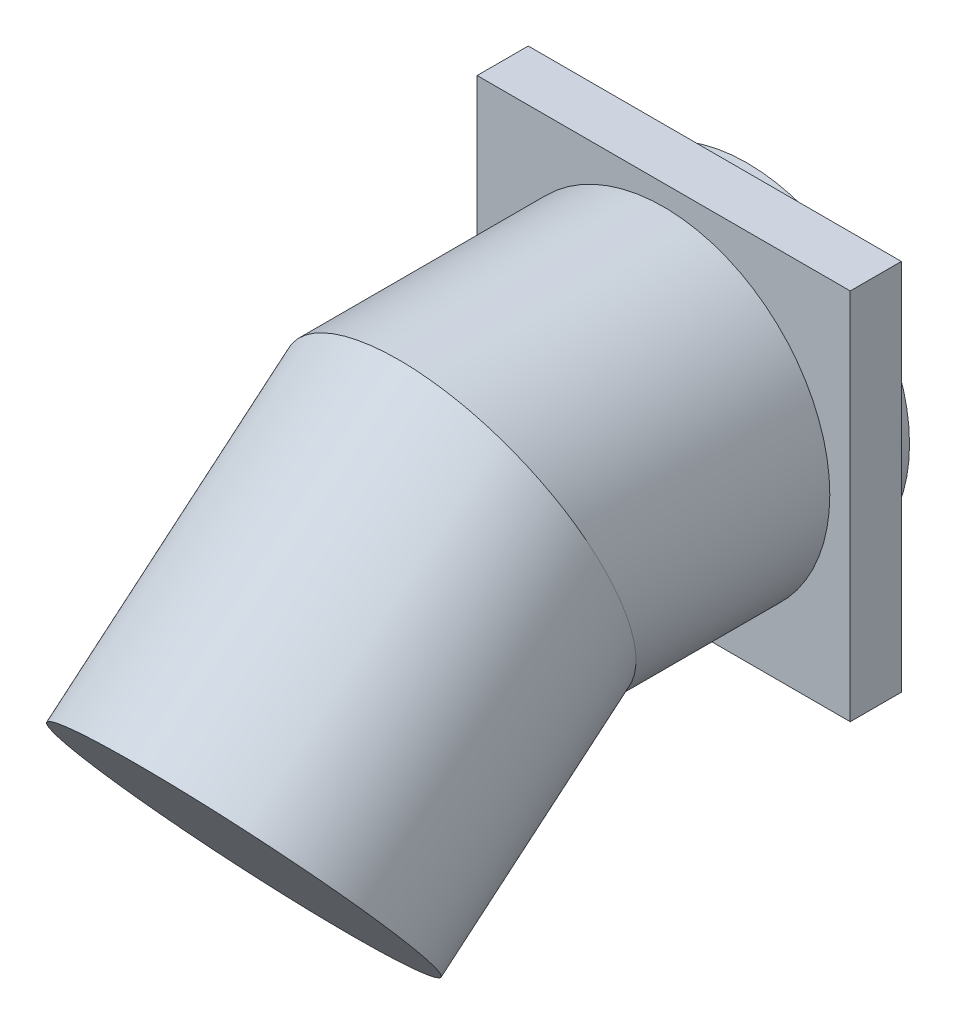
ISO-10303-21;
HEADER;
FILE_DESCRIPTION(('STEP AP214'),'2;1');
FILE_NAME('part.step','',(''),(''),'','','');
FILE_SCHEMA(('AUTOMOTIVE_DESIGN { 1 0 10303 214 1 1 1 1 }'));
ENDSEC;
DATA;
#1=APPLICATION_CONTEXT('core data for automotive mechanical design processes');
#2=APPLICATION_PROTOCOL_DEFINITION('international standard','automotive_design',2000,#1);
#3=PRODUCT_CONTEXT('',#1,'mechanical');
#4=PRODUCT('Part','Part','',(#3));
#5=PRODUCT_RELATED_PRODUCT_CATEGORY('part','',(#4));
#6=PRODUCT_DEFINITION_FORMATION('','',#4);
#7=PRODUCT_DEFINITION_CONTEXT('part definition',#1,'design');
#8=PRODUCT_DEFINITION('design','',#6,#7);
#9=PRODUCT_DEFINITION_SHAPE('','',#8);
#10=(LENGTH_UNIT() NAMED_UNIT(*) SI_UNIT(.MILLI.,.METRE.));
#11=(NAMED_UNIT(*) PLANE_ANGLE_UNIT() SI_UNIT($,.RADIAN.));
#12=(NAMED_UNIT(*) SI_UNIT($,.STERADIAN.) SOLID_ANGLE_UNIT());
#13=UNCERTAINTY_MEASURE_WITH_UNIT(LENGTH_MEASURE(1.E-05),#10,'distance_accuracy_value','');
#14=(GEOMETRIC_REPRESENTATION_CONTEXT(3) GLOBAL_UNCERTAINTY_ASSIGNED_CONTEXT((#13)) GLOBAL_UNIT_ASSIGNED_CONTEXT((#10,
#11,#12)) REPRESENTATION_CONTEXT('',''));
#15=CARTESIAN_POINT('',(0.,0.,0.));
#16=DIRECTION('',(0.,0.,1.));
#17=DIRECTION('',(1.,0.,0.));
#18=AXIS2_PLACEMENT_3D('',#15,#16,#17);
#19=CARTESIAN_POINT('',(-73.,73.,20.));
#20=DIRECTION('',(1.,0.,0.));
#21=DIRECTION('',(0.,1.,0.));
#22=AXIS2_PLACEMENT_3D('',#19,#20,#21);
#23=PLANE('',#22);
#24=DIRECTION('',(0.,-1.,0.));
#25=VECTOR('',#24,1.);
#26=CARTESIAN_POINT('',(-73.,73.,0.));
#27=LINE('',#26,#25);
#28=CARTESIAN_POINT('',(-73.,73.,0.));
#29=VERTEX_POINT('',#28);
#30=CARTESIAN_POINT('',(-73.,-73.,0.));
#31=VERTEX_POINT('',#30);
#32=EDGE_CURVE('E101',#29,#31,#27,.T.);
#33=ORIENTED_EDGE('',*,*,#32,.T.);
#34=DIRECTION('',(0.,0.,-1.));
#35=VECTOR('',#34,1.);
#36=CARTESIAN_POINT('',(-73.,-73.,20.));
#37=LINE('',#36,#35);
#38=CARTESIAN_POINT('',(-73.,-73.,20.));
#39=VERTEX_POINT('',#38);
#40=EDGE_CURVE('E37',#39,#31,#37,.T.);
#41=ORIENTED_EDGE('',*,*,#40,.F.);
#42=DIRECTION('',(0.,-1.,0.));
#43=VECTOR('',#42,1.);
#44=CARTESIAN_POINT('',(-73.,73.,20.));
#45=LINE('',#44,#43);
#46=CARTESIAN_POINT('',(-73.,73.,20.));
#47=VERTEX_POINT('',#46);
#48=EDGE_CURVE('E88',#47,#39,#45,.T.);
#49=ORIENTED_EDGE('',*,*,#48,.F.);
#50=DIRECTION('',(0.,0.,-1.));
#51=VECTOR('',#50,1.);
#52=CARTESIAN_POINT('',(-73.,73.,20.));
#53=LINE('',#52,#51);
#54=EDGE_CURVE('E97',#47,#29,#53,.T.);
#55=ORIENTED_EDGE('',*,*,#54,.T.);
#56=EDGE_LOOP('',(#33,#41,#49,#55));
#57=FACE_BOUND('',#56,.T.);
#58=ADVANCED_FACE('F34',(#57),#23,.F.);
#59=CARTESIAN_POINT('',(-73.,-73.,20.));
#60=DIRECTION('',(0.,1.,0.));
#61=DIRECTION('',(0.,0.,1.));
#62=AXIS2_PLACEMENT_3D('',#59,#60,#61);
#63=PLANE('',#62);
#64=DIRECTION('',(1.,0.,0.));
#65=VECTOR('',#64,1.);
#66=CARTESIAN_POINT('',(-73.,-73.,0.));
#67=LINE('',#66,#65);
#68=CARTESIAN_POINT('',(73.,-73.,0.));
#69=VERTEX_POINT('',#68);
#70=EDGE_CURVE('E93',#31,#69,#67,.T.);
#71=ORIENTED_EDGE('',*,*,#70,.T.);
#72=DIRECTION('',(0.,0.,-1.));
#73=VECTOR('',#72,1.);
#74=CARTESIAN_POINT('',(73.,-73.,20.));
#75=LINE('',#74,#73);
#76=CARTESIAN_POINT('',(73.,-73.,20.));
#77=VERTEX_POINT('',#76);
#78=EDGE_CURVE('E91',#77,#69,#75,.T.);
#79=ORIENTED_EDGE('',*,*,#78,.F.);
#80=DIRECTION('',(1.,0.,0.));
#81=VECTOR('',#80,1.);
#82=CARTESIAN_POINT('',(-73.,-73.,20.));
#83=LINE('',#82,#81);
#84=EDGE_CURVE('E83',#39,#77,#83,.T.);
#85=ORIENTED_EDGE('',*,*,#84,.F.);
#86=ORIENTED_EDGE('',*,*,#40,.T.);
#87=EDGE_LOOP('',(#71,#79,#85,#86));
#88=FACE_BOUND('',#87,.T.);
#89=ADVANCED_FACE('F92',(#88),#63,.F.);
#90=CARTESIAN_POINT('',(73.,73.,20.));
#91=DIRECTION('',(-1.,0.,0.));
#92=DIRECTION('',(0.,-1.,0.));
#93=AXIS2_PLACEMENT_3D('',#90,#91,#92);
#94=PLANE('',#93);
#95=DIRECTION('',(0.,1.,0.));
#96=VECTOR('',#95,1.);
#97=CARTESIAN_POINT('',(73.,73.,0.));
#98=LINE('',#97,#96);
#99=CARTESIAN_POINT('',(73.,73.,0.));
#100=VERTEX_POINT('',#99);
#101=EDGE_CURVE('E69',#69,#100,#98,.T.);
#102=ORIENTED_EDGE('',*,*,#101,.T.);
#103=DIRECTION('',(0.,0.,-1.));
#104=VECTOR('',#103,1.);
#105=CARTESIAN_POINT('',(73.,73.,20.));
#106=LINE('',#105,#104);
#107=CARTESIAN_POINT('',(73.,73.,20.));
#108=VERTEX_POINT('',#107);
#109=EDGE_CURVE('E94',#108,#100,#106,.T.);
#110=ORIENTED_EDGE('',*,*,#109,.F.);
#111=DIRECTION('',(0.,1.,0.));
#112=VECTOR('',#111,1.);
#113=CARTESIAN_POINT('',(73.,73.,20.));
#114=LINE('',#113,#112);
#115=EDGE_CURVE('E86',#77,#108,#114,.T.);
#116=ORIENTED_EDGE('',*,*,#115,.F.);
#117=ORIENTED_EDGE('',*,*,#78,.T.);
#118=EDGE_LOOP('',(#102,#110,#116,#117));
#119=FACE_BOUND('',#118,.T.);
#120=ADVANCED_FACE('F95',(#119),#94,.F.);
#121=CARTESIAN_POINT('',(-73.,73.,20.));
#122=DIRECTION('',(0.,-1.,0.));
#123=DIRECTION('',(0.,0.,-1.));
#124=AXIS2_PLACEMENT_3D('',#121,#122,#123);
#125=PLANE('',#124);
#126=DIRECTION('',(-1.,0.,0.));
#127=VECTOR('',#126,1.);
#128=CARTESIAN_POINT('',(-73.,73.,0.));
#129=LINE('',#128,#127);
#130=EDGE_CURVE('E75',#100,#29,#129,.T.);
#131=ORIENTED_EDGE('',*,*,#130,.T.);
#132=ORIENTED_EDGE('',*,*,#54,.F.);
#133=DIRECTION('',(-1.,0.,0.));
#134=VECTOR('',#133,1.);
#135=CARTESIAN_POINT('',(-73.,73.,20.));
#136=LINE('',#135,#134);
#137=EDGE_CURVE('E52',#108,#47,#136,.T.);
#138=ORIENTED_EDGE('',*,*,#137,.F.);
#139=ORIENTED_EDGE('',*,*,#109,.T.);
#140=EDGE_LOOP('',(#131,#132,#138,#139));
#141=FACE_BOUND('',#140,.T.);
#142=ADVANCED_FACE('F109',(#141),#125,.F.);
#143=CARTESIAN_POINT('',(0.,0.,20.));
#144=DIRECTION('',(0.,0.,1.));
#145=DIRECTION('',(1.,0.,0.));
#146=AXIS2_PLACEMENT_3D('',#143,#144,#145);
#147=PLANE('',#146);
#148=CARTESIAN_POINT('',(0.,0.,20.));
#149=DIRECTION('',(0.,0.,1.));
#150=DIRECTION('',(1.,0.,0.));
#151=AXIS2_PLACEMENT_3D('',#148,#149,#150);
#152=CIRCLE('',#151,65.);
#153=CARTESIAN_POINT('',(65.,0.,20.));
#154=VERTEX_POINT('',#153);
#155=EDGE_CURVE('E11',#154,#154,#152,.T.);
#156=ORIENTED_EDGE('',*,*,#155,.F.);
#157=EDGE_LOOP('',(#156));
#158=FACE_BOUND('',#157,.T.);
#159=ORIENTED_EDGE('',*,*,#48,.T.);
#160=ORIENTED_EDGE('',*,*,#84,.T.);
#161=ORIENTED_EDGE('',*,*,#115,.T.);
#162=ORIENTED_EDGE('',*,*,#137,.T.);
#163=EDGE_LOOP('',(#159,#160,#161,#162));
#164=FACE_BOUND('',#163,.T.);
#165=ADVANCED_FACE('F84',(#158,#164),#147,.T.);
#166=CARTESIAN_POINT('',(0.,0.,0.));
#167=DIRECTION('',(0.,0.,1.));
#168=DIRECTION('',(1.,0.,0.));
#169=AXIS2_PLACEMENT_3D('',#166,#167,#168);
#170=PLANE('',#169);
#171=CARTESIAN_POINT('',(0.,0.,0.));
#172=DIRECTION('',(0.,0.,-1.));
#173=DIRECTION('',(-1.,0.,0.));
#174=AXIS2_PLACEMENT_3D('',#171,#172,#173);
#175=CIRCLE('',#174,63.5);
#176=CARTESIAN_POINT('',(-63.5,0.,0.));
#177=VERTEX_POINT('',#176);
#178=EDGE_CURVE('E43',#177,#177,#175,.T.);
#179=ORIENTED_EDGE('',*,*,#178,.F.);
#180=EDGE_LOOP('',(#179));
#181=FACE_BOUND('',#180,.T.);
#182=ORIENTED_EDGE('',*,*,#32,.F.);
#183=ORIENTED_EDGE('',*,*,#130,.F.);
#184=ORIENTED_EDGE('',*,*,#101,.F.);
#185=ORIENTED_EDGE('',*,*,#70,.F.);
#186=EDGE_LOOP('',(#182,#183,#184,#185));
#187=FACE_BOUND('',#186,.T.);
#188=ADVANCED_FACE('F112',(#181,#187),#170,.F.);
#189=CARTESIAN_POINT('',(0.,0.,-12.7));
#190=DIRECTION('',(0.,0.,1.));
#191=DIRECTION('',(1.,0.,0.));
#192=AXIS2_PLACEMENT_3D('',#189,#190,#191);
#193=CYLINDRICAL_SURFACE('',#192,63.5);
#194=CARTESIAN_POINT('',(0.,0.,-12.7));
#195=DIRECTION('',(0.,0.,-1.));
#196=DIRECTION('',(-1.,0.,0.));
#197=AXIS2_PLACEMENT_3D('',#194,#195,#196);
#198=CIRCLE('',#197,63.5);
#199=CARTESIAN_POINT('',(-63.5,0.,-12.7));
#200=VERTEX_POINT('',#199);
#201=EDGE_CURVE('E104',#200,#200,#198,.T.);
#202=ORIENTED_EDGE('',*,*,#201,.F.);
#203=EDGE_LOOP('',(#202));
#204=FACE_BOUND('',#203,.T.);
#205=ORIENTED_EDGE('',*,*,#178,.T.);
#206=EDGE_LOOP('',(#205));
#207=FACE_BOUND('',#206,.T.);
#208=ADVANCED_FACE('F141',(#204,#207),#193,.T.);
#209=CARTESIAN_POINT('',(0.,0.,-12.7));
#210=DIRECTION('',(0.,0.,-1.));
#211=DIRECTION('',(-1.,0.,0.));
#212=AXIS2_PLACEMENT_3D('',#209,#210,#211);
#213=PLANE('',#212);
#214=ORIENTED_EDGE('',*,*,#201,.T.);
#215=EDGE_LOOP('',(#214));
#216=FACE_BOUND('',#215,.T.);
#217=ADVANCED_FACE('F136',(#216),#213,.T.);
#218=CARTESIAN_POINT('',(0.,-70.7066370655195,184.264888743087));
#219=DIRECTION('',(0.,-0.642787609686541,0.766044443118977));
#220=DIRECTION('',(1.,0.,0.));
#221=AXIS2_PLACEMENT_3D('',#218,#219,#220);
#222=PLANE('',#221);
#223=CARTESIAN_POINT('',(0.,-70.7066370655195,184.264888743087));
#224=DIRECTION('',(0.,-0.642787609686541,0.766044443118977));
#225=DIRECTION('',(1.,0.,0.));
#226=AXIS2_PLACEMENT_3D('',#223,#224,#225);
#227=CIRCLE('',#226,65.);
#228=CARTESIAN_POINT('',(65.,-70.7066370655195,184.264888743087));
#229=VERTEX_POINT('',#228);
#230=EDGE_CURVE('E120',#229,#229,#227,.T.);
#231=ORIENTED_EDGE('',*,*,#230,.T.);
#232=EDGE_LOOP('',(#231));
#233=FACE_BOUND('',#232,.T.);
#234=ADVANCED_FACE('F131',(#233),#222,.T.);
#235=CARTESIAN_POINT('',(0.,33.519923394955,60.0525108705799));
#236=DIRECTION('',(0.,-0.642787609686541,0.766044443118977));
#237=DIRECTION('',(0.,-0.766044443118977,-0.642787609686541));
#238=AXIS2_PLACEMENT_3D('',#235,#236,#237);
#239=CYLINDRICAL_SURFACE('',#238,65.);
#240=CARTESIAN_POINT('',(0.,0.,100.));
#241=DIRECTION('',(0.,-0.34202014332567,0.939692620785908));
#242=DIRECTION('',(0.,0.939692620785908,0.34202014332567));
#243=AXIS2_PLACEMENT_3D('',#240,#241,#242);
#244=ELLIPSE('',#243,69.1715552109343,65.);
#245=CARTESIAN_POINT('',(0.,65.,123.658065227303));
#246=VERTEX_POINT('',#245);
#247=EDGE_CURVE('E119',#246,#246,#244,.F.);
#248=ORIENTED_EDGE('',*,*,#247,.F.);
#249=EDGE_LOOP('',(#248));
#250=FACE_BOUND('',#249,.T.);
#251=ORIENTED_EDGE('',*,*,#230,.F.);
#252=EDGE_LOOP('',(#251));
#253=FACE_BOUND('',#252,.T.);
#254=ADVANCED_FACE('F128',(#250,#253),#239,.T.);
#255=CARTESIAN_POINT('',(0.,0.,20.));
#256=DIRECTION('',(0.,0.,1.));
#257=DIRECTION('',(1.,0.,0.));
#258=AXIS2_PLACEMENT_3D('',#255,#256,#257);
#259=CYLINDRICAL_SURFACE('',#258,65.);
#260=ORIENTED_EDGE('',*,*,#155,.T.);
#261=EDGE_LOOP('',(#260));
#262=FACE_BOUND('',#261,.T.);
#263=ORIENTED_EDGE('',*,*,#247,.T.);
#264=EDGE_LOOP('',(#263));
#265=FACE_BOUND('',#264,.T.);
#266=ADVANCED_FACE('F126',(#262,#265),#259,.T.);
#267=CLOSED_SHELL('',(#58,#89,#120,#142,#165,#188,#208,#217,#234,#254,#266));
#268=MANIFOLD_SOLID_BREP('B2',#267);
#269=ADVANCED_BREP_SHAPE_REPRESENTATION('',(#18,#268),#14);
#270=SHAPE_DEFINITION_REPRESENTATION(#9,#269);
ENDSEC;
END-ISO-10303-21;
